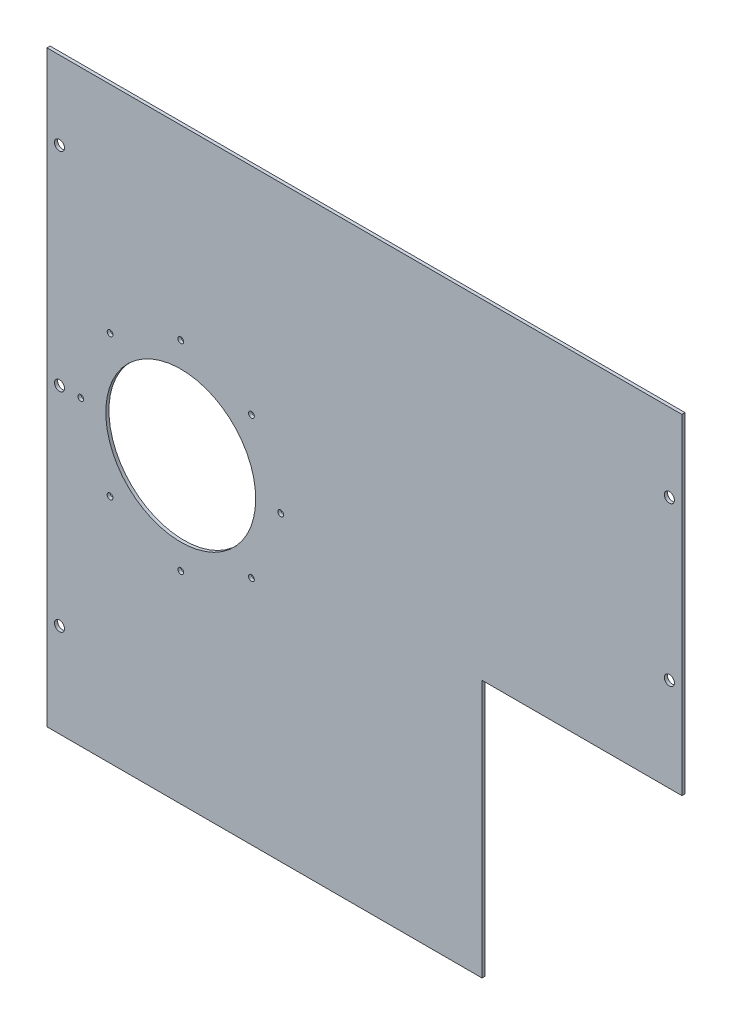
ISO-10303-21;
HEADER;
FILE_DESCRIPTION(('STEP AP214'),'2;1');
FILE_NAME('part.step','',(''),(''),'','','');
FILE_SCHEMA(('AUTOMOTIVE_DESIGN { 1 0 10303 214 1 1 1 1 }'));
ENDSEC;
DATA;
#1=APPLICATION_CONTEXT('core data for automotive mechanical design processes');
#2=APPLICATION_PROTOCOL_DEFINITION('international standard','automotive_design',2000,#1);
#3=PRODUCT_CONTEXT('',#1,'mechanical');
#4=PRODUCT('Part','Part','',(#3));
#5=PRODUCT_RELATED_PRODUCT_CATEGORY('part','',(#4));
#6=PRODUCT_DEFINITION_FORMATION('','',#4);
#7=PRODUCT_DEFINITION_CONTEXT('part definition',#1,'design');
#8=PRODUCT_DEFINITION('design','',#6,#7);
#9=PRODUCT_DEFINITION_SHAPE('','',#8);
#10=(LENGTH_UNIT() NAMED_UNIT(*) SI_UNIT(.MILLI.,.METRE.));
#11=(NAMED_UNIT(*) PLANE_ANGLE_UNIT() SI_UNIT($,.RADIAN.));
#12=(NAMED_UNIT(*) SI_UNIT($,.STERADIAN.) SOLID_ANGLE_UNIT());
#13=UNCERTAINTY_MEASURE_WITH_UNIT(LENGTH_MEASURE(1.E-05),#10,'distance_accuracy_value','');
#14=(GEOMETRIC_REPRESENTATION_CONTEXT(3) GLOBAL_UNCERTAINTY_ASSIGNED_CONTEXT((#13)) GLOBAL_UNIT_ASSIGNED_CONTEXT((#10,
#11,#12)) REPRESENTATION_CONTEXT('',''));
#15=CARTESIAN_POINT('',(0.,0.,0.));
#16=DIRECTION('',(0.,0.,1.));
#17=DIRECTION('',(1.,0.,0.));
#18=AXIS2_PLACEMENT_3D('',#15,#16,#17);
#19=CARTESIAN_POINT('',(-161.3627,145.48590835,1.6002));
#20=DIRECTION('',(1.,0.,0.));
#21=DIRECTION('',(0.,1.,0.));
#22=AXIS2_PLACEMENT_3D('',#19,#20,#21);
#23=PLANE('',#22);
#24=DIRECTION('',(0.,-1.,0.));
#25=VECTOR('',#24,1.);
#26=CARTESIAN_POINT('',(-161.3627,145.48590835,0.));
#27=LINE('',#26,#25);
#28=CARTESIAN_POINT('',(-161.3627,145.48590835,0.));
#29=VERTEX_POINT('',#28);
#30=CARTESIAN_POINT('',(-161.3627,-153.41070835,0.));
#31=VERTEX_POINT('',#30);
#32=EDGE_CURVE('E118',#29,#31,#27,.T.);
#33=ORIENTED_EDGE('',*,*,#32,.T.);
#34=DIRECTION('',(0.,0.,-1.));
#35=VECTOR('',#34,1.);
#36=CARTESIAN_POINT('',(-161.3627,-153.41070835,1.6002));
#37=LINE('',#36,#35);
#38=CARTESIAN_POINT('',(-161.3627,-153.41070835,1.6002));
#39=VERTEX_POINT('',#38);
#40=EDGE_CURVE('E11',#39,#31,#37,.T.);
#41=ORIENTED_EDGE('',*,*,#40,.F.);
#42=DIRECTION('',(0.,-1.,0.));
#43=VECTOR('',#42,1.);
#44=CARTESIAN_POINT('',(-161.3627,145.48590835,1.6002));
#45=LINE('',#44,#43);
#46=CARTESIAN_POINT('',(-161.3627,145.48590835,1.6002));
#47=VERTEX_POINT('',#46);
#48=EDGE_CURVE('E129',#47,#39,#45,.T.);
#49=ORIENTED_EDGE('',*,*,#48,.F.);
#50=DIRECTION('',(0.,0.,-1.));
#51=VECTOR('',#50,1.);
#52=CARTESIAN_POINT('',(-161.3627,145.48590835,1.6002));
#53=LINE('',#52,#51);
#54=EDGE_CURVE('E114',#47,#29,#53,.T.);
#55=ORIENTED_EDGE('',*,*,#54,.T.);
#56=EDGE_LOOP('',(#33,#41,#49,#55));
#57=FACE_BOUND('',#56,.T.);
#58=ADVANCED_FACE('F32',(#57),#23,.F.);
#59=CARTESIAN_POINT('',(-161.3627,-153.41070835,1.6002));
#60=DIRECTION('',(0.,1.,0.));
#61=DIRECTION('',(-1.,0.,0.));
#62=AXIS2_PLACEMENT_3D('',#59,#60,#61);
#63=PLANE('',#62);
#64=DIRECTION('',(1.,0.,0.));
#65=VECTOR('',#64,1.);
#66=CARTESIAN_POINT('',(-161.3627,-153.41070835,0.));
#67=LINE('',#66,#65);
#68=CARTESIAN_POINT('',(59.7625000000001,-153.41070835,0.));
#69=VERTEX_POINT('',#68);
#70=EDGE_CURVE('E121',#31,#69,#67,.T.);
#71=ORIENTED_EDGE('',*,*,#70,.T.);
#72=DIRECTION('',(0.,0.,-1.));
#73=VECTOR('',#72,1.);
#74=CARTESIAN_POINT('',(59.7625000000001,-153.41070835,1.6002));
#75=LINE('',#74,#73);
#76=CARTESIAN_POINT('',(59.7625000000001,-153.41070835,1.6002));
#77=VERTEX_POINT('',#76);
#78=EDGE_CURVE('E41',#77,#69,#75,.T.);
#79=ORIENTED_EDGE('',*,*,#78,.F.);
#80=DIRECTION('',(1.,0.,0.));
#81=VECTOR('',#80,1.);
#82=CARTESIAN_POINT('',(-161.3627,-153.41070835,1.6002));
#83=LINE('',#82,#81);
#84=EDGE_CURVE('E87',#39,#77,#83,.T.);
#85=ORIENTED_EDGE('',*,*,#84,.F.);
#86=ORIENTED_EDGE('',*,*,#40,.T.);
#87=EDGE_LOOP('',(#71,#79,#85,#86));
#88=FACE_BOUND('',#87,.T.);
#89=ADVANCED_FACE('F169',(#88),#63,.F.);
#90=CARTESIAN_POINT('',(59.7625000000001,-22.3467083500001,1.6002));
#91=DIRECTION('',(-1.,0.,0.));
#92=DIRECTION('',(0.,-1.,0.));
#93=AXIS2_PLACEMENT_3D('',#90,#91,#92);
#94=PLANE('',#93);
#95=DIRECTION('',(0.,1.,0.));
#96=VECTOR('',#95,1.);
#97=CARTESIAN_POINT('',(59.7625000000001,-22.3467083500001,0.));
#98=LINE('',#97,#96);
#99=CARTESIAN_POINT('',(59.7625000000001,-22.3467083500001,0.));
#100=VERTEX_POINT('',#99);
#101=EDGE_CURVE('E124',#69,#100,#98,.T.);
#102=ORIENTED_EDGE('',*,*,#101,.T.);
#103=DIRECTION('',(0.,0.,-1.));
#104=VECTOR('',#103,1.);
#105=CARTESIAN_POINT('',(59.7625000000001,-22.3467083500001,1.6002));
#106=LINE('',#105,#104);
#107=CARTESIAN_POINT('',(59.7625000000001,-22.3467083500001,1.6002));
#108=VERTEX_POINT('',#107);
#109=EDGE_CURVE('E109',#108,#100,#106,.T.);
#110=ORIENTED_EDGE('',*,*,#109,.F.);
#111=DIRECTION('',(0.,1.,0.));
#112=VECTOR('',#111,1.);
#113=CARTESIAN_POINT('',(59.7625000000001,-22.3467083500001,1.6002));
#114=LINE('',#113,#112);
#115=EDGE_CURVE('E100',#77,#108,#114,.T.);
#116=ORIENTED_EDGE('',*,*,#115,.F.);
#117=ORIENTED_EDGE('',*,*,#78,.T.);
#118=EDGE_LOOP('',(#102,#110,#116,#117));
#119=FACE_BOUND('',#118,.T.);
#120=ADVANCED_FACE('F172',(#119),#94,.F.);
#121=CARTESIAN_POINT('',(161.3627,-22.34670835,1.6002));
#122=DIRECTION('',(0.,1.,0.));
#123=DIRECTION('',(-1.,0.,0.));
#124=AXIS2_PLACEMENT_3D('',#121,#122,#123);
#125=PLANE('',#124);
#126=DIRECTION('',(1.,0.,0.));
#127=VECTOR('',#126,1.);
#128=CARTESIAN_POINT('',(161.3627,-22.34670835,0.));
#129=LINE('',#128,#127);
#130=CARTESIAN_POINT('',(161.3627,-22.34670835,0.));
#131=VERTEX_POINT('',#130);
#132=EDGE_CURVE('E108',#100,#131,#129,.T.);
#133=ORIENTED_EDGE('',*,*,#132,.T.);
#134=DIRECTION('',(0.,0.,-1.));
#135=VECTOR('',#134,1.);
#136=CARTESIAN_POINT('',(161.3627,-22.34670835,1.6002));
#137=LINE('',#136,#135);
#138=CARTESIAN_POINT('',(161.3627,-22.34670835,1.6002));
#139=VERTEX_POINT('',#138);
#140=EDGE_CURVE('E105',#139,#131,#137,.T.);
#141=ORIENTED_EDGE('',*,*,#140,.F.);
#142=DIRECTION('',(1.,0.,0.));
#143=VECTOR('',#142,1.);
#144=CARTESIAN_POINT('',(161.3627,-22.34670835,1.6002));
#145=LINE('',#144,#143);
#146=EDGE_CURVE('E94',#108,#139,#145,.T.);
#147=ORIENTED_EDGE('',*,*,#146,.F.);
#148=ORIENTED_EDGE('',*,*,#109,.T.);
#149=EDGE_LOOP('',(#133,#141,#147,#148));
#150=FACE_BOUND('',#149,.T.);
#151=ADVANCED_FACE('F106',(#150),#125,.F.);
#152=CARTESIAN_POINT('',(161.3627,145.48590835,1.6002));
#153=DIRECTION('',(-1.,0.,0.));
#154=DIRECTION('',(0.,-1.,0.));
#155=AXIS2_PLACEMENT_3D('',#152,#153,#154);
#156=PLANE('',#155);
#157=DIRECTION('',(0.,1.,0.));
#158=VECTOR('',#157,1.);
#159=CARTESIAN_POINT('',(161.3627,145.48590835,0.));
#160=LINE('',#159,#158);
#161=CARTESIAN_POINT('',(161.3627,145.48590835,0.));
#162=VERTEX_POINT('',#161);
#163=EDGE_CURVE('E73',#131,#162,#160,.T.);
#164=ORIENTED_EDGE('',*,*,#163,.T.);
#165=DIRECTION('',(0.,0.,-1.));
#166=VECTOR('',#165,1.);
#167=CARTESIAN_POINT('',(161.3627,145.48590835,1.6002));
#168=LINE('',#167,#166);
#169=CARTESIAN_POINT('',(161.3627,145.48590835,1.6002));
#170=VERTEX_POINT('',#169);
#171=EDGE_CURVE('E110',#170,#162,#168,.T.);
#172=ORIENTED_EDGE('',*,*,#171,.F.);
#173=DIRECTION('',(0.,1.,0.));
#174=VECTOR('',#173,1.);
#175=CARTESIAN_POINT('',(161.3627,145.48590835,1.6002));
#176=LINE('',#175,#174);
#177=EDGE_CURVE('E98',#139,#170,#176,.T.);
#178=ORIENTED_EDGE('',*,*,#177,.F.);
#179=ORIENTED_EDGE('',*,*,#140,.T.);
#180=EDGE_LOOP('',(#164,#172,#178,#179));
#181=FACE_BOUND('',#180,.T.);
#182=ADVANCED_FACE('F112',(#181),#156,.F.);
#183=CARTESIAN_POINT('',(-161.3627,145.48590835,1.6002));
#184=DIRECTION('',(0.,-1.,0.));
#185=DIRECTION('',(1.,0.,0.));
#186=AXIS2_PLACEMENT_3D('',#183,#184,#185);
#187=PLANE('',#186);
#188=DIRECTION('',(-1.,0.,0.));
#189=VECTOR('',#188,1.);
#190=CARTESIAN_POINT('',(-161.3627,145.48590835,0.));
#191=LINE('',#190,#189);
#192=EDGE_CURVE('E79',#162,#29,#191,.T.);
#193=ORIENTED_EDGE('',*,*,#192,.T.);
#194=ORIENTED_EDGE('',*,*,#54,.F.);
#195=DIRECTION('',(-1.,0.,0.));
#196=VECTOR('',#195,1.);
#197=CARTESIAN_POINT('',(-161.3627,145.48590835,1.6002));
#198=LINE('',#197,#196);
#199=EDGE_CURVE('E50',#170,#47,#198,.T.);
#200=ORIENTED_EDGE('',*,*,#199,.F.);
#201=ORIENTED_EDGE('',*,*,#171,.T.);
#202=EDGE_LOOP('',(#193,#194,#200,#201));
#203=FACE_BOUND('',#202,.T.);
#204=ADVANCED_FACE('F177',(#203),#187,.F.);
#205=CARTESIAN_POINT('',(0.,0.,1.6002));
#206=DIRECTION('',(0.,0.,1.));
#207=DIRECTION('',(1.,0.,0.));
#208=AXIS2_PLACEMENT_3D('',#205,#206,#207);
#209=PLANE('',#208);
#210=CARTESIAN_POINT('',(-155.,105.78570835,1.6002));
#211=DIRECTION('',(0.,0.,1.));
#212=DIRECTION('',(1.,0.,0.));
#213=AXIS2_PLACEMENT_3D('',#210,#211,#212);
#214=CIRCLE('',#213,2.55269999999999);
#215=CARTESIAN_POINT('',(-152.4473,105.78570835,1.6002));
#216=VERTEX_POINT('',#215);
#217=EDGE_CURVE('E370',#216,#216,#214,.T.);
#218=ORIENTED_EDGE('',*,*,#217,.F.);
#219=EDGE_LOOP('',(#218));
#220=FACE_BOUND('',#219,.T.);
#221=CARTESIAN_POINT('',(155.,105.78570835,1.6002));
#222=DIRECTION('',(0.,0.,1.));
#223=DIRECTION('',(1.,0.,0.));
#224=AXIS2_PLACEMENT_3D('',#221,#222,#223);
#225=CIRCLE('',#224,2.55269999999999);
#226=CARTESIAN_POINT('',(157.5527,105.78570835,1.6002));
#227=VERTEX_POINT('',#226);
#228=EDGE_CURVE('E374',#227,#227,#225,.T.);
#229=ORIENTED_EDGE('',*,*,#228,.F.);
#230=EDGE_LOOP('',(#229));
#231=FACE_BOUND('',#230,.T.);
#232=CARTESIAN_POINT('',(-155.,-105.78570835,1.6002));
#233=DIRECTION('',(0.,0.,1.));
#234=DIRECTION('',(1.,0.,0.));
#235=AXIS2_PLACEMENT_3D('',#232,#233,#234);
#236=CIRCLE('',#235,2.55269999999999);
#237=CARTESIAN_POINT('',(-152.4473,-105.78570835,1.6002));
#238=VERTEX_POINT('',#237);
#239=EDGE_CURVE('E383',#238,#238,#236,.T.);
#240=ORIENTED_EDGE('',*,*,#239,.F.);
#241=EDGE_LOOP('',(#240));
#242=FACE_BOUND('',#241,.T.);
#243=CARTESIAN_POINT('',(155.,25.27849165,1.6002));
#244=DIRECTION('',(0.,0.,1.));
#245=DIRECTION('',(1.,0.,0.));
#246=AXIS2_PLACEMENT_3D('',#243,#244,#245);
#247=CIRCLE('',#246,2.55269999999999);
#248=CARTESIAN_POINT('',(157.5527,25.27849165,1.6002));
#249=VERTEX_POINT('',#248);
#250=EDGE_CURVE('E389',#249,#249,#247,.T.);
#251=ORIENTED_EDGE('',*,*,#250,.F.);
#252=EDGE_LOOP('',(#251));
#253=FACE_BOUND('',#252,.T.);
#254=CARTESIAN_POINT('',(-155.,0.,1.6002));
#255=DIRECTION('',(0.,0.,1.));
#256=DIRECTION('',(1.,0.,0.));
#257=AXIS2_PLACEMENT_3D('',#254,#255,#256);
#258=CIRCLE('',#257,2.55269999999999);
#259=CARTESIAN_POINT('',(-152.4473,0.,1.6002));
#260=VERTEX_POINT('',#259);
#261=EDGE_CURVE('E395',#260,#260,#258,.T.);
#262=ORIENTED_EDGE('',*,*,#261,.F.);
#263=EDGE_LOOP('',(#262));
#264=FACE_BOUND('',#263,.T.);
#265=CARTESIAN_POINT('',(-57.4416755157238,35.921024484277,1.6002));
#266=DIRECTION('',(0.,0.,1.));
#267=DIRECTION('',(1.,0.,0.));
#268=AXIS2_PLACEMENT_3D('',#265,#266,#267);
#269=CIRCLE('',#268,1.47319999999999);
#270=CARTESIAN_POINT('',(-55.9684755157238,35.921024484277,1.6002));
#271=VERTEX_POINT('',#270);
#272=EDGE_CURVE('E401',#271,#271,#269,.T.);
#273=ORIENTED_EDGE('',*,*,#272,.F.);
#274=EDGE_LOOP('',(#273));
#275=FACE_BOUND('',#274,.T.);
#276=CARTESIAN_POINT('',(-42.5627,5.27355936696949E-13,1.6002));
#277=DIRECTION('',(0.,0.,1.));
#278=DIRECTION('',(1.,0.,0.));
#279=AXIS2_PLACEMENT_3D('',#276,#277,#278);
#280=CIRCLE('',#279,1.47319999999999);
#281=CARTESIAN_POINT('',(-41.0895,5.27355936696949E-13,1.6002));
#282=VERTEX_POINT('',#281);
#283=EDGE_CURVE('E404',#282,#282,#280,.T.);
#284=ORIENTED_EDGE('',*,*,#283,.F.);
#285=EDGE_LOOP('',(#284));
#286=FACE_BOUND('',#285,.T.);
#287=CARTESIAN_POINT('',(-57.4416755157231,-35.9210244842763,1.6002));
#288=DIRECTION('',(0.,0.,1.));
#289=DIRECTION('',(1.,0.,0.));
#290=AXIS2_PLACEMENT_3D('',#287,#288,#289);
#291=CIRCLE('',#290,1.47319999999999);
#292=CARTESIAN_POINT('',(-55.9684755157231,-35.9210244842763,1.6002));
#293=VERTEX_POINT('',#292);
#294=EDGE_CURVE('E410',#293,#293,#291,.T.);
#295=ORIENTED_EDGE('',*,*,#294,.F.);
#296=EDGE_LOOP('',(#295));
#297=FACE_BOUND('',#296,.T.);
#298=CARTESIAN_POINT('',(-93.3627,-50.8,1.6002));
#299=DIRECTION('',(0.,0.,1.));
#300=DIRECTION('',(1.,0.,0.));
#301=AXIS2_PLACEMENT_3D('',#298,#299,#300);
#302=CIRCLE('',#301,1.47319999999999);
#303=CARTESIAN_POINT('',(-91.8895,-50.8,1.6002));
#304=VERTEX_POINT('',#303);
#305=EDGE_CURVE('E416',#304,#304,#302,.T.);
#306=ORIENTED_EDGE('',*,*,#305,.F.);
#307=EDGE_LOOP('',(#306));
#308=FACE_BOUND('',#307,.T.);
#309=CARTESIAN_POINT('',(-129.283724484276,-35.9210244842768,1.6002));
#310=DIRECTION('',(0.,0.,1.));
#311=DIRECTION('',(1.,0.,0.));
#312=AXIS2_PLACEMENT_3D('',#309,#310,#311);
#313=CIRCLE('',#312,1.47319999999998);
#314=CARTESIAN_POINT('',(-127.810524484276,-35.9210244842768,1.6002));
#315=VERTEX_POINT('',#314);
#316=EDGE_CURVE('E154',#315,#315,#313,.T.);
#317=ORIENTED_EDGE('',*,*,#316,.F.);
#318=EDGE_LOOP('',(#317));
#319=FACE_BOUND('',#318,.T.);
#320=CARTESIAN_POINT('',(-144.1627,-1.80411241501588E-13,1.6002));
#321=DIRECTION('',(0.,0.,1.));
#322=DIRECTION('',(1.,0.,0.));
#323=AXIS2_PLACEMENT_3D('',#320,#321,#322);
#324=CIRCLE('',#323,1.47319999999998);
#325=CARTESIAN_POINT('',(-142.6895,-1.80411241501588E-13,1.6002));
#326=VERTEX_POINT('',#325);
#327=EDGE_CURVE('E142',#326,#326,#324,.T.);
#328=ORIENTED_EDGE('',*,*,#327,.F.);
#329=EDGE_LOOP('',(#328));
#330=FACE_BOUND('',#329,.T.);
#331=CARTESIAN_POINT('',(-129.283724484277,35.9210244842766,1.6002));
#332=DIRECTION('',(0.,0.,1.));
#333=DIRECTION('',(1.,0.,0.));
#334=AXIS2_PLACEMENT_3D('',#331,#332,#333);
#335=CIRCLE('',#334,1.47319999999998);
#336=CARTESIAN_POINT('',(-127.810524484277,35.9210244842766,1.6002));
#337=VERTEX_POINT('',#336);
#338=EDGE_CURVE('E141',#337,#337,#335,.T.);
#339=ORIENTED_EDGE('',*,*,#338,.F.);
#340=EDGE_LOOP('',(#339));
#341=FACE_BOUND('',#340,.T.);
#342=CARTESIAN_POINT('',(-93.3627,50.8,1.6002));
#343=DIRECTION('',(0.,0.,1.));
#344=DIRECTION('',(1.,0.,0.));
#345=AXIS2_PLACEMENT_3D('',#342,#343,#344);
#346=CIRCLE('',#345,1.47319999999999);
#347=CARTESIAN_POINT('',(-91.8895,50.8,1.6002));
#348=VERTEX_POINT('',#347);
#349=EDGE_CURVE('E138',#348,#348,#346,.T.);
#350=ORIENTED_EDGE('',*,*,#349,.F.);
#351=EDGE_LOOP('',(#350));
#352=FACE_BOUND('',#351,.T.);
#353=CARTESIAN_POINT('',(-93.3627,0.,1.6002));
#354=DIRECTION('',(0.,0.,1.));
#355=DIRECTION('',(1.,0.,0.));
#356=AXIS2_PLACEMENT_3D('',#353,#354,#355);
#357=CIRCLE('',#356,38.1);
#358=CARTESIAN_POINT('',(-55.2627,0.,1.6002));
#359=VERTEX_POINT('',#358);
#360=EDGE_CURVE('E137',#359,#359,#357,.T.);
#361=ORIENTED_EDGE('',*,*,#360,.F.);
#362=EDGE_LOOP('',(#361));
#363=FACE_BOUND('',#362,.T.);
#364=ORIENTED_EDGE('',*,*,#48,.T.);
#365=ORIENTED_EDGE('',*,*,#84,.T.);
#366=ORIENTED_EDGE('',*,*,#115,.T.);
#367=ORIENTED_EDGE('',*,*,#146,.T.);
#368=ORIENTED_EDGE('',*,*,#177,.T.);
#369=ORIENTED_EDGE('',*,*,#199,.T.);
#370=EDGE_LOOP('',(#364,#365,#366,#367,#368,#369));
#371=FACE_BOUND('',#370,.T.);
#372=ADVANCED_FACE('F96',(#220,#231,#242,#253,#264,#275,#286,#297,#308,#319,#330,#341,#352,#363,
#371),#209,.T.);
#373=CARTESIAN_POINT('',(0.,0.,0.));
#374=DIRECTION('',(0.,0.,1.));
#375=DIRECTION('',(1.,0.,0.));
#376=AXIS2_PLACEMENT_3D('',#373,#374,#375);
#377=PLANE('',#376);
#378=CARTESIAN_POINT('',(-155.,105.78570835,0.));
#379=DIRECTION('',(0.,0.,1.));
#380=DIRECTION('',(1.,0.,0.));
#381=AXIS2_PLACEMENT_3D('',#378,#379,#380);
#382=CIRCLE('',#381,2.55269999999998);
#383=CARTESIAN_POINT('',(-152.4473,105.78570835,0.));
#384=VERTEX_POINT('',#383);
#385=EDGE_CURVE('E373',#384,#384,#382,.T.);
#386=ORIENTED_EDGE('',*,*,#385,.T.);
#387=EDGE_LOOP('',(#386));
#388=FACE_BOUND('',#387,.T.);
#389=CARTESIAN_POINT('',(155.,105.78570835,0.));
#390=DIRECTION('',(0.,0.,1.));
#391=DIRECTION('',(1.,0.,0.));
#392=AXIS2_PLACEMENT_3D('',#389,#390,#391);
#393=CIRCLE('',#392,2.55269999999998);
#394=CARTESIAN_POINT('',(157.5527,105.78570835,0.));
#395=VERTEX_POINT('',#394);
#396=EDGE_CURVE('E377',#395,#395,#393,.T.);
#397=ORIENTED_EDGE('',*,*,#396,.T.);
#398=EDGE_LOOP('',(#397));
#399=FACE_BOUND('',#398,.T.);
#400=CARTESIAN_POINT('',(-155.,-105.78570835,0.));
#401=DIRECTION('',(0.,0.,1.));
#402=DIRECTION('',(1.,0.,0.));
#403=AXIS2_PLACEMENT_3D('',#400,#401,#402);
#404=CIRCLE('',#403,2.55269999999998);
#405=CARTESIAN_POINT('',(-152.4473,-105.78570835,0.));
#406=VERTEX_POINT('',#405);
#407=EDGE_CURVE('E386',#406,#406,#404,.T.);
#408=ORIENTED_EDGE('',*,*,#407,.T.);
#409=EDGE_LOOP('',(#408));
#410=FACE_BOUND('',#409,.T.);
#411=CARTESIAN_POINT('',(155.,25.27849165,0.));
#412=DIRECTION('',(0.,0.,1.));
#413=DIRECTION('',(1.,0.,0.));
#414=AXIS2_PLACEMENT_3D('',#411,#412,#413);
#415=CIRCLE('',#414,2.55269999999998);
#416=CARTESIAN_POINT('',(157.5527,25.27849165,0.));
#417=VERTEX_POINT('',#416);
#418=EDGE_CURVE('E392',#417,#417,#415,.T.);
#419=ORIENTED_EDGE('',*,*,#418,.T.);
#420=EDGE_LOOP('',(#419));
#421=FACE_BOUND('',#420,.T.);
#422=CARTESIAN_POINT('',(-155.,0.,0.));
#423=DIRECTION('',(0.,0.,1.));
#424=DIRECTION('',(1.,0.,0.));
#425=AXIS2_PLACEMENT_3D('',#422,#423,#424);
#426=CIRCLE('',#425,2.55269999999998);
#427=CARTESIAN_POINT('',(-152.4473,0.,0.));
#428=VERTEX_POINT('',#427);
#429=EDGE_CURVE('E398',#428,#428,#426,.T.);
#430=ORIENTED_EDGE('',*,*,#429,.T.);
#431=EDGE_LOOP('',(#430));
#432=FACE_BOUND('',#431,.T.);
#433=CARTESIAN_POINT('',(-57.4416755157238,35.921024484277,0.));
#434=DIRECTION('',(0.,0.,1.));
#435=DIRECTION('',(1.,0.,0.));
#436=AXIS2_PLACEMENT_3D('',#433,#434,#435);
#437=CIRCLE('',#436,1.47319999999998);
#438=CARTESIAN_POINT('',(-55.9684755157238,35.921024484277,0.));
#439=VERTEX_POINT('',#438);
#440=EDGE_CURVE('E35',#439,#439,#437,.T.);
#441=ORIENTED_EDGE('',*,*,#440,.T.);
#442=EDGE_LOOP('',(#441));
#443=FACE_BOUND('',#442,.T.);
#444=CARTESIAN_POINT('',(-42.5627,5.27355936696949E-13,0.));
#445=DIRECTION('',(0.,0.,1.));
#446=DIRECTION('',(1.,0.,0.));
#447=AXIS2_PLACEMENT_3D('',#444,#445,#446);
#448=CIRCLE('',#447,1.47319999999998);
#449=CARTESIAN_POINT('',(-41.0895,5.27355936696949E-13,0.));
#450=VERTEX_POINT('',#449);
#451=EDGE_CURVE('E407',#450,#450,#448,.T.);
#452=ORIENTED_EDGE('',*,*,#451,.T.);
#453=EDGE_LOOP('',(#452));
#454=FACE_BOUND('',#453,.T.);
#455=CARTESIAN_POINT('',(-57.4416755157231,-35.9210244842763,0.));
#456=DIRECTION('',(0.,0.,1.));
#457=DIRECTION('',(1.,0.,0.));
#458=AXIS2_PLACEMENT_3D('',#455,#456,#457);
#459=CIRCLE('',#458,1.47319999999998);
#460=CARTESIAN_POINT('',(-55.9684755157231,-35.9210244842763,0.));
#461=VERTEX_POINT('',#460);
#462=EDGE_CURVE('E413',#461,#461,#459,.T.);
#463=ORIENTED_EDGE('',*,*,#462,.T.);
#464=EDGE_LOOP('',(#463));
#465=FACE_BOUND('',#464,.T.);
#466=CARTESIAN_POINT('',(-93.3627,-50.8,0.));
#467=DIRECTION('',(0.,0.,1.));
#468=DIRECTION('',(1.,0.,0.));
#469=AXIS2_PLACEMENT_3D('',#466,#467,#468);
#470=CIRCLE('',#469,1.47319999999998);
#471=CARTESIAN_POINT('',(-91.8895,-50.8,0.));
#472=VERTEX_POINT('',#471);
#473=EDGE_CURVE('E419',#472,#472,#470,.T.);
#474=ORIENTED_EDGE('',*,*,#473,.T.);
#475=EDGE_LOOP('',(#474));
#476=FACE_BOUND('',#475,.T.);
#477=CARTESIAN_POINT('',(-129.283724484276,-35.9210244842768,0.));
#478=DIRECTION('',(0.,0.,1.));
#479=DIRECTION('',(1.,0.,0.));
#480=AXIS2_PLACEMENT_3D('',#477,#478,#479);
#481=CIRCLE('',#480,1.47319999999998);
#482=CARTESIAN_POINT('',(-127.810524484276,-35.9210244842768,0.));
#483=VERTEX_POINT('',#482);
#484=EDGE_CURVE('E149',#483,#483,#481,.T.);
#485=ORIENTED_EDGE('',*,*,#484,.T.);
#486=EDGE_LOOP('',(#485));
#487=FACE_BOUND('',#486,.T.);
#488=CARTESIAN_POINT('',(-144.1627,-1.80411241501588E-13,0.));
#489=DIRECTION('',(0.,0.,1.));
#490=DIRECTION('',(1.,0.,0.));
#491=AXIS2_PLACEMENT_3D('',#488,#489,#490);
#492=CIRCLE('',#491,1.47319999999998);
#493=CARTESIAN_POINT('',(-142.6895,-1.80411241501588E-13,0.));
#494=VERTEX_POINT('',#493);
#495=EDGE_CURVE('E139',#494,#494,#492,.T.);
#496=ORIENTED_EDGE('',*,*,#495,.T.);
#497=EDGE_LOOP('',(#496));
#498=FACE_BOUND('',#497,.T.);
#499=CARTESIAN_POINT('',(-129.283724484277,35.9210244842766,0.));
#500=DIRECTION('',(0.,0.,1.));
#501=DIRECTION('',(1.,0.,0.));
#502=AXIS2_PLACEMENT_3D('',#499,#500,#501);
#503=CIRCLE('',#502,1.47319999999998);
#504=CARTESIAN_POINT('',(-127.810524484277,35.9210244842766,0.));
#505=VERTEX_POINT('',#504);
#506=EDGE_CURVE('E146',#505,#505,#503,.T.);
#507=ORIENTED_EDGE('',*,*,#506,.T.);
#508=EDGE_LOOP('',(#507));
#509=FACE_BOUND('',#508,.T.);
#510=CARTESIAN_POINT('',(-93.3627,50.8,0.));
#511=DIRECTION('',(0.,0.,1.));
#512=DIRECTION('',(1.,0.,0.));
#513=AXIS2_PLACEMENT_3D('',#510,#511,#512);
#514=CIRCLE('',#513,1.47319999999998);
#515=CARTESIAN_POINT('',(-91.8895,50.8,0.));
#516=VERTEX_POINT('',#515);
#517=EDGE_CURVE('E135',#516,#516,#514,.T.);
#518=ORIENTED_EDGE('',*,*,#517,.T.);
#519=EDGE_LOOP('',(#518));
#520=FACE_BOUND('',#519,.T.);
#521=CARTESIAN_POINT('',(-93.3627,0.,0.));
#522=DIRECTION('',(0.,0.,1.));
#523=DIRECTION('',(1.,0.,0.));
#524=AXIS2_PLACEMENT_3D('',#521,#522,#523);
#525=CIRCLE('',#524,38.1);
#526=CARTESIAN_POINT('',(-55.2627,0.,0.));
#527=VERTEX_POINT('',#526);
#528=EDGE_CURVE('E122',#527,#527,#525,.T.);
#529=ORIENTED_EDGE('',*,*,#528,.T.);
#530=EDGE_LOOP('',(#529));
#531=FACE_BOUND('',#530,.T.);
#532=ORIENTED_EDGE('',*,*,#32,.F.);
#533=ORIENTED_EDGE('',*,*,#192,.F.);
#534=ORIENTED_EDGE('',*,*,#163,.F.);
#535=ORIENTED_EDGE('',*,*,#132,.F.);
#536=ORIENTED_EDGE('',*,*,#101,.F.);
#537=ORIENTED_EDGE('',*,*,#70,.F.);
#538=EDGE_LOOP('',(#532,#533,#534,#535,#536,#537));
#539=FACE_BOUND('',#538,.T.);
#540=ADVANCED_FACE('F175',(#388,#399,#410,#421,#432,#443,#454,#465,#476,#487,#498,#509,#520,
#531,#539),#377,.F.);
#541=CARTESIAN_POINT('',(-93.3627,0.,0.));
#542=DIRECTION('',(0.,0.,1.));
#543=DIRECTION('',(1.,0.,0.));
#544=AXIS2_PLACEMENT_3D('',#541,#542,#543);
#545=CYLINDRICAL_SURFACE('',#544,38.1);
#546=ORIENTED_EDGE('',*,*,#528,.F.);
#547=EDGE_LOOP('',(#546));
#548=FACE_BOUND('',#547,.T.);
#549=ORIENTED_EDGE('',*,*,#360,.T.);
#550=EDGE_LOOP('',(#549));
#551=FACE_BOUND('',#550,.T.);
#552=ADVANCED_FACE('F216',(#548,#551),#545,.F.);
#553=CARTESIAN_POINT('',(-93.3627,50.8,1.6002));
#554=DIRECTION('',(0.,0.,1.));
#555=DIRECTION('',(1.,0.,0.));
#556=AXIS2_PLACEMENT_3D('',#553,#554,#555);
#557=CYLINDRICAL_SURFACE('',#556,1.47319999999998);
#558=ORIENTED_EDGE('',*,*,#349,.T.);
#559=EDGE_LOOP('',(#558));
#560=FACE_BOUND('',#559,.T.);
#561=ORIENTED_EDGE('',*,*,#517,.F.);
#562=EDGE_LOOP('',(#561));
#563=FACE_BOUND('',#562,.T.);
#564=ADVANCED_FACE('F221',(#560,#563),#557,.F.);
#565=CARTESIAN_POINT('',(-129.283724484277,35.9210244842766,1.6002));
#566=DIRECTION('',(0.,0.,1.));
#567=DIRECTION('',(1.,0.,0.));
#568=AXIS2_PLACEMENT_3D('',#565,#566,#567);
#569=CYLINDRICAL_SURFACE('',#568,1.47319999999998);
#570=ORIENTED_EDGE('',*,*,#338,.T.);
#571=EDGE_LOOP('',(#570));
#572=FACE_BOUND('',#571,.T.);
#573=ORIENTED_EDGE('',*,*,#506,.F.);
#574=EDGE_LOOP('',(#573));
#575=FACE_BOUND('',#574,.T.);
#576=ADVANCED_FACE('F233',(#572,#575),#569,.F.);
#577=CARTESIAN_POINT('',(-144.1627,-1.80411241501588E-13,1.6002));
#578=DIRECTION('',(0.,0.,1.));
#579=DIRECTION('',(1.,0.,0.));
#580=AXIS2_PLACEMENT_3D('',#577,#578,#579);
#581=CYLINDRICAL_SURFACE('',#580,1.47319999999998);
#582=ORIENTED_EDGE('',*,*,#327,.T.);
#583=EDGE_LOOP('',(#582));
#584=FACE_BOUND('',#583,.T.);
#585=ORIENTED_EDGE('',*,*,#495,.F.);
#586=EDGE_LOOP('',(#585));
#587=FACE_BOUND('',#586,.T.);
#588=ADVANCED_FACE('F243',(#584,#587),#581,.F.);
#589=CARTESIAN_POINT('',(-129.283724484276,-35.9210244842768,1.6002));
#590=DIRECTION('',(0.,0.,1.));
#591=DIRECTION('',(1.,0.,0.));
#592=AXIS2_PLACEMENT_3D('',#589,#590,#591);
#593=CYLINDRICAL_SURFACE('',#592,1.47319999999998);
#594=ORIENTED_EDGE('',*,*,#316,.T.);
#595=EDGE_LOOP('',(#594));
#596=FACE_BOUND('',#595,.T.);
#597=ORIENTED_EDGE('',*,*,#484,.F.);
#598=EDGE_LOOP('',(#597));
#599=FACE_BOUND('',#598,.T.);
#600=ADVANCED_FACE('F253',(#596,#599),#593,.F.);
#601=CARTESIAN_POINT('',(-93.3627,-50.8,1.6002));
#602=DIRECTION('',(0.,0.,1.));
#603=DIRECTION('',(1.,0.,0.));
#604=AXIS2_PLACEMENT_3D('',#601,#602,#603);
#605=CYLINDRICAL_SURFACE('',#604,1.47319999999998);
#606=ORIENTED_EDGE('',*,*,#305,.T.);
#607=EDGE_LOOP('',(#606));
#608=FACE_BOUND('',#607,.T.);
#609=ORIENTED_EDGE('',*,*,#473,.F.);
#610=EDGE_LOOP('',(#609));
#611=FACE_BOUND('',#610,.T.);
#612=ADVANCED_FACE('F262',(#608,#611),#605,.F.);
#613=CARTESIAN_POINT('',(-57.4416755157231,-35.9210244842763,1.6002));
#614=DIRECTION('',(0.,0.,1.));
#615=DIRECTION('',(1.,0.,0.));
#616=AXIS2_PLACEMENT_3D('',#613,#614,#615);
#617=CYLINDRICAL_SURFACE('',#616,1.47319999999998);
#618=ORIENTED_EDGE('',*,*,#294,.T.);
#619=EDGE_LOOP('',(#618));
#620=FACE_BOUND('',#619,.T.);
#621=ORIENTED_EDGE('',*,*,#462,.F.);
#622=EDGE_LOOP('',(#621));
#623=FACE_BOUND('',#622,.T.);
#624=ADVANCED_FACE('F272',(#620,#623),#617,.F.);
#625=CARTESIAN_POINT('',(-42.5627,5.27355936696949E-13,1.6002));
#626=DIRECTION('',(0.,0.,1.));
#627=DIRECTION('',(1.,0.,0.));
#628=AXIS2_PLACEMENT_3D('',#625,#626,#627);
#629=CYLINDRICAL_SURFACE('',#628,1.47319999999998);
#630=ORIENTED_EDGE('',*,*,#283,.T.);
#631=EDGE_LOOP('',(#630));
#632=FACE_BOUND('',#631,.T.);
#633=ORIENTED_EDGE('',*,*,#451,.F.);
#634=EDGE_LOOP('',(#633));
#635=FACE_BOUND('',#634,.T.);
#636=ADVANCED_FACE('F282',(#632,#635),#629,.F.);
#637=CARTESIAN_POINT('',(-57.4416755157238,35.921024484277,1.6002));
#638=DIRECTION('',(0.,0.,1.));
#639=DIRECTION('',(1.,0.,0.));
#640=AXIS2_PLACEMENT_3D('',#637,#638,#639);
#641=CYLINDRICAL_SURFACE('',#640,1.47319999999998);
#642=ORIENTED_EDGE('',*,*,#272,.T.);
#643=EDGE_LOOP('',(#642));
#644=FACE_BOUND('',#643,.T.);
#645=ORIENTED_EDGE('',*,*,#440,.F.);
#646=EDGE_LOOP('',(#645));
#647=FACE_BOUND('',#646,.T.);
#648=ADVANCED_FACE('F292',(#644,#647),#641,.F.);
#649=CARTESIAN_POINT('',(-155.,0.,1.6002));
#650=DIRECTION('',(0.,0.,1.));
#651=DIRECTION('',(1.,0.,0.));
#652=AXIS2_PLACEMENT_3D('',#649,#650,#651);
#653=CYLINDRICAL_SURFACE('',#652,2.55269999999998);
#654=ORIENTED_EDGE('',*,*,#261,.T.);
#655=EDGE_LOOP('',(#654));
#656=FACE_BOUND('',#655,.T.);
#657=ORIENTED_EDGE('',*,*,#429,.F.);
#658=EDGE_LOOP('',(#657));
#659=FACE_BOUND('',#658,.T.);
#660=ADVANCED_FACE('F302',(#656,#659),#653,.F.);
#661=CARTESIAN_POINT('',(155.,25.27849165,1.6002));
#662=DIRECTION('',(0.,0.,1.));
#663=DIRECTION('',(1.,0.,0.));
#664=AXIS2_PLACEMENT_3D('',#661,#662,#663);
#665=CYLINDRICAL_SURFACE('',#664,2.55269999999998);
#666=ORIENTED_EDGE('',*,*,#250,.T.);
#667=EDGE_LOOP('',(#666));
#668=FACE_BOUND('',#667,.T.);
#669=ORIENTED_EDGE('',*,*,#418,.F.);
#670=EDGE_LOOP('',(#669));
#671=FACE_BOUND('',#670,.T.);
#672=ADVANCED_FACE('F323',(#668,#671),#665,.F.);
#673=CARTESIAN_POINT('',(-155.,-105.78570835,1.6002));
#674=DIRECTION('',(0.,0.,1.));
#675=DIRECTION('',(1.,0.,0.));
#676=AXIS2_PLACEMENT_3D('',#673,#674,#675);
#677=CYLINDRICAL_SURFACE('',#676,2.55269999999998);
#678=ORIENTED_EDGE('',*,*,#239,.T.);
#679=EDGE_LOOP('',(#678));
#680=FACE_BOUND('',#679,.T.);
#681=ORIENTED_EDGE('',*,*,#407,.F.);
#682=EDGE_LOOP('',(#681));
#683=FACE_BOUND('',#682,.T.);
#684=ADVANCED_FACE('F333',(#680,#683),#677,.F.);
#685=CARTESIAN_POINT('',(155.,105.78570835,1.6002));
#686=DIRECTION('',(0.,0.,1.));
#687=DIRECTION('',(1.,0.,0.));
#688=AXIS2_PLACEMENT_3D('',#685,#686,#687);
#689=CYLINDRICAL_SURFACE('',#688,2.55269999999998);
#690=ORIENTED_EDGE('',*,*,#228,.T.);
#691=EDGE_LOOP('',(#690));
#692=FACE_BOUND('',#691,.T.);
#693=ORIENTED_EDGE('',*,*,#396,.F.);
#694=EDGE_LOOP('',(#693));
#695=FACE_BOUND('',#694,.T.);
#696=ADVANCED_FACE('F343',(#692,#695),#689,.F.);
#697=CARTESIAN_POINT('',(-155.,105.78570835,1.6002));
#698=DIRECTION('',(0.,0.,1.));
#699=DIRECTION('',(1.,0.,0.));
#700=AXIS2_PLACEMENT_3D('',#697,#698,#699);
#701=CYLINDRICAL_SURFACE('',#700,2.55269999999998);
#702=ORIENTED_EDGE('',*,*,#217,.T.);
#703=EDGE_LOOP('',(#702));
#704=FACE_BOUND('',#703,.T.);
#705=ORIENTED_EDGE('',*,*,#385,.F.);
#706=EDGE_LOOP('',(#705));
#707=FACE_BOUND('',#706,.T.);
#708=ADVANCED_FACE('F353',(#704,#707),#701,.F.);
#709=CLOSED_SHELL('',(#58,#89,#120,#151,#182,#204,#372,#540,#552,#564,#576,#588,#600,#612,#624,
#636,#648,#660,#672,#684,#696,#708));
#710=MANIFOLD_SOLID_BREP('B2',#709);
#711=ADVANCED_BREP_SHAPE_REPRESENTATION('',(#18,#710),#14);
#712=SHAPE_DEFINITION_REPRESENTATION(#9,#711);
ENDSEC;
END-ISO-10303-21;
